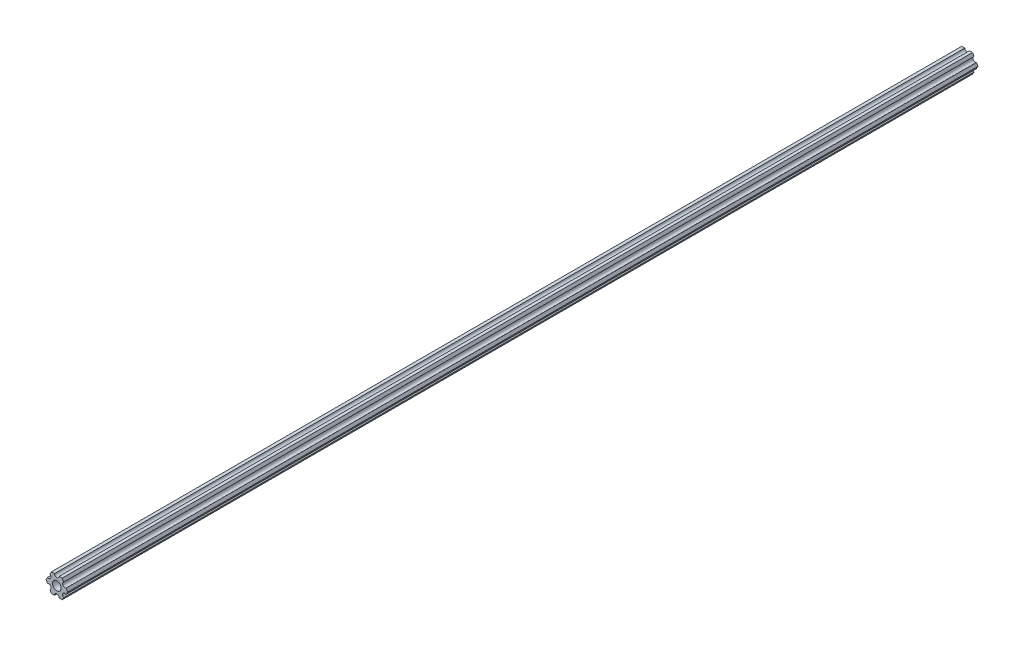
ISO-10303-21;
HEADER;
FILE_DESCRIPTION(('STEP AP214'),'2;1');
FILE_NAME('part.step','',(''),(''),'','','');
FILE_SCHEMA(('AUTOMOTIVE_DESIGN { 1 0 10303 214 1 1 1 1 }'));
ENDSEC;
DATA;
#1=APPLICATION_CONTEXT('core data for automotive mechanical design processes');
#2=APPLICATION_PROTOCOL_DEFINITION('international standard','automotive_design',2000,#1);
#3=PRODUCT_CONTEXT('',#1,'mechanical');
#4=PRODUCT('Part','Part','',(#3));
#5=PRODUCT_RELATED_PRODUCT_CATEGORY('part','',(#4));
#6=PRODUCT_DEFINITION_FORMATION('','',#4);
#7=PRODUCT_DEFINITION_CONTEXT('part definition',#1,'design');
#8=PRODUCT_DEFINITION('design','',#6,#7);
#9=PRODUCT_DEFINITION_SHAPE('','',#8);
#10=(LENGTH_UNIT() NAMED_UNIT(*) SI_UNIT(.MILLI.,.METRE.));
#11=(NAMED_UNIT(*) PLANE_ANGLE_UNIT() SI_UNIT($,.RADIAN.));
#12=(NAMED_UNIT(*) SI_UNIT($,.STERADIAN.) SOLID_ANGLE_UNIT());
#13=UNCERTAINTY_MEASURE_WITH_UNIT(LENGTH_MEASURE(1.E-05),#10,'distance_accuracy_value','');
#14=(GEOMETRIC_REPRESENTATION_CONTEXT(3) GLOBAL_UNCERTAINTY_ASSIGNED_CONTEXT((#13)) GLOBAL_UNIT_ASSIGNED_CONTEXT((#10,
#11,#12)) REPRESENTATION_CONTEXT('',''));
#15=CARTESIAN_POINT('',(0.,0.,0.));
#16=DIRECTION('',(0.,0.,1.));
#17=DIRECTION('',(1.,0.,0.));
#18=AXIS2_PLACEMENT_3D('',#15,#16,#17);
#19=CARTESIAN_POINT('',(5.49926112168156,3.17500033315933,615.95));
#20=DIRECTION('',(0.,0.,1.));
#21=DIRECTION('',(1.,0.,0.));
#22=AXIS2_PLACEMENT_3D('',#19,#20,#21);
#23=PLANE('',#22);
#24=DIRECTION('',(0.499999947533953,0.866025434075723,0.));
#25=VECTOR('',#24,1.);
#26=CARTESIAN_POINT('',(6.29301142309098,-1.80018429024546,615.95));
#27=LINE('',#26,#25);
#28=CARTESIAN_POINT('',(6.29301142309098,-1.80018429024546,615.95));
#29=VERTEX_POINT('',#28);
#30=CARTESIAN_POINT('',(7.33234841870826,4.44212519169686E-07,615.95));
#31=VERTEX_POINT('',#30);
#32=EDGE_CURVE('E226',#29,#31,#27,.T.);
#33=ORIENTED_EDGE('',*,*,#32,.T.);
#34=DIRECTION('',(-0.500000052466056,0.866025373493145,0.));
#35=VECTOR('',#34,1.);
#36=CARTESIAN_POINT('',(7.33234841870826,4.44212519169686E-07,615.95));
#37=LINE('',#36,#35);
#38=CARTESIAN_POINT('',(6.29301120497139,1.80018505273894,615.95));
#39=VERTEX_POINT('',#38);
#40=EDGE_CURVE('E124',#31,#39,#37,.T.);
#41=ORIENTED_EDGE('',*,*,#40,.T.);
#42=CARTESIAN_POINT('',(5.49926112168156,3.17500033315933,615.95));
#43=DIRECTION('',(0.,0.,-1.));
#44=DIRECTION('',(1.,0.,0.));
#45=AXIS2_PLACEMENT_3D('',#42,#43,#44);
#46=CIRCLE('',#45,1.5875);
#47=CARTESIAN_POINT('',(4.70551103839172,4.54981561357972,615.95));
#48=VERTEX_POINT('',#47);
#49=EDGE_CURVE('E271',#39,#48,#46,.T.);
#50=ORIENTED_EDGE('',*,*,#49,.T.);
#51=DIRECTION('',(-0.500000052466046,0.866025373493151,0.));
#52=VECTOR('',#51,1.);
#53=CARTESIAN_POINT('',(4.70551103839172,4.54981561357972,615.95));
#54=LINE('',#53,#52);
#55=CARTESIAN_POINT('',(3.66617382465481,6.35000022210627,615.95));
#56=VERTEX_POINT('',#55);
#57=EDGE_CURVE('E290',#48,#56,#54,.T.);
#58=ORIENTED_EDGE('',*,*,#57,.T.);
#59=DIRECTION('',(-0.999999999999998,-6.05825850611185E-08,0.));
#60=VECTOR('',#59,1.);
#61=CARTESIAN_POINT('',(3.66617382465481,6.35000022210627,615.95));
#62=LINE('',#61,#60);
#63=CARTESIAN_POINT('',(1.58749961530074,6.35000009617482,615.95));
#64=VERTEX_POINT('',#63);
#65=EDGE_CURVE('E287',#56,#64,#62,.T.);
#66=ORIENTED_EDGE('',*,*,#65,.T.);
#67=CARTESIAN_POINT('',(-3.84699260060323E-07,6.35,615.95));
#68=DIRECTION('',(0.,0.,-1.));
#69=DIRECTION('',(1.,0.,0.));
#70=AXIS2_PLACEMENT_3D('',#67,#68,#69);
#71=CIRCLE('',#70,1.5875);
#72=CARTESIAN_POINT('',(-1.58750038469926,6.34999990382518,615.95));
#73=VERTEX_POINT('',#72);
#74=EDGE_CURVE('E289',#64,#73,#71,.T.);
#75=ORIENTED_EDGE('',*,*,#74,.T.);
#76=DIRECTION('',(-0.999999999999998,-6.05825963273174E-08,0.));
#77=VECTOR('',#76,1.);
#78=CARTESIAN_POINT('',(-1.58750038469926,6.34999990382518,615.95));
#79=LINE('',#78,#77);
#80=CARTESIAN_POINT('',(-3.66617459405349,6.3499997778937,615.95));
#81=VERTEX_POINT('',#80);
#82=EDGE_CURVE('E292',#73,#81,#79,.T.);
#83=ORIENTED_EDGE('',*,*,#82,.T.);
#84=DIRECTION('',(-0.499999947533942,-0.866025434075729,0.));
#85=VECTOR('',#84,1.);
#86=CARTESIAN_POINT('',(-3.66617459405349,6.3499997778937,615.95));
#87=LINE('',#86,#85);
#88=CARTESIAN_POINT('',(-4.70551158967065,4.54981504343587,615.95));
#89=VERTEX_POINT('',#88);
#90=EDGE_CURVE('E298',#81,#89,#87,.T.);
#91=ORIENTED_EDGE('',*,*,#90,.T.);
#92=CARTESIAN_POINT('',(-5.49926150638082,3.17499966684067,615.95));
#93=DIRECTION('',(0.,0.,-1.));
#94=DIRECTION('',(1.,0.,0.));
#95=AXIS2_PLACEMENT_3D('',#92,#93,#94);
#96=CIRCLE('',#95,1.5875);
#97=CARTESIAN_POINT('',(-6.29301142309098,1.80018429024547,615.95));
#98=VERTEX_POINT('',#97);
#99=EDGE_CURVE('E300',#89,#98,#96,.T.);
#100=ORIENTED_EDGE('',*,*,#99,.T.);
#101=DIRECTION('',(-0.499999947533951,-0.866025434075724,0.));
#102=VECTOR('',#101,1.);
#103=CARTESIAN_POINT('',(-6.29301142309098,1.80018429024547,615.95));
#104=LINE('',#103,#102);
#105=CARTESIAN_POINT('',(-7.33234841870826,-4.44212523790841E-07,615.95));
#106=VERTEX_POINT('',#105);
#107=EDGE_CURVE('E302',#98,#106,#104,.T.);
#108=ORIENTED_EDGE('',*,*,#107,.T.);
#109=DIRECTION('',(0.500000052466045,-0.866025373493151,0.));
#110=VECTOR('',#109,1.);
#111=CARTESIAN_POINT('',(-7.33234841870826,-4.44212523790841E-07,615.95));
#112=LINE('',#111,#110);
#113=CARTESIAN_POINT('',(-6.29301120497141,-1.80018505273897,615.95));
#114=VERTEX_POINT('',#113);
#115=EDGE_CURVE('E304',#106,#114,#112,.T.);
#116=ORIENTED_EDGE('',*,*,#115,.T.);
#117=CARTESIAN_POINT('',(-5.49926112168156,-3.17500033315934,615.95));
#118=DIRECTION('',(0.,0.,-1.));
#119=DIRECTION('',(1.,0.,0.));
#120=AXIS2_PLACEMENT_3D('',#117,#118,#119);
#121=CIRCLE('',#120,1.5875);
#122=CARTESIAN_POINT('',(-4.70551103839172,-4.54981561357972,615.95));
#123=VERTEX_POINT('',#122);
#124=EDGE_CURVE('E306',#114,#123,#121,.T.);
#125=ORIENTED_EDGE('',*,*,#124,.T.);
#126=DIRECTION('',(0.500000052466045,-0.866025373493151,0.));
#127=VECTOR('',#126,1.);
#128=CARTESIAN_POINT('',(-4.70551103839172,-4.54981561357972,615.95));
#129=LINE('',#128,#127);
#130=CARTESIAN_POINT('',(-3.66617382465481,-6.35000022210628,615.95));
#131=VERTEX_POINT('',#130);
#132=EDGE_CURVE('E308',#123,#131,#129,.T.);
#133=ORIENTED_EDGE('',*,*,#132,.T.);
#134=DIRECTION('',(0.999999999999998,6.05825854783851E-08,0.));
#135=VECTOR('',#134,1.);
#136=CARTESIAN_POINT('',(-3.66617382465481,-6.35000022210628,615.95));
#137=LINE('',#136,#135);
#138=CARTESIAN_POINT('',(-1.58749961530074,-6.35000009617482,615.95));
#139=VERTEX_POINT('',#138);
#140=EDGE_CURVE('E310',#131,#139,#137,.T.);
#141=ORIENTED_EDGE('',*,*,#140,.T.);
#142=CARTESIAN_POINT('',(3.8469926204343E-07,-6.35,615.95));
#143=DIRECTION('',(0.,0.,-1.));
#144=DIRECTION('',(1.,0.,0.));
#145=AXIS2_PLACEMENT_3D('',#142,#143,#144);
#146=CIRCLE('',#145,1.5875);
#147=CARTESIAN_POINT('',(1.58750038469926,-6.34999990382518,615.95));
#148=VERTEX_POINT('',#147);
#149=EDGE_CURVE('E173',#139,#148,#146,.T.);
#150=ORIENTED_EDGE('',*,*,#149,.T.);
#151=DIRECTION('',(0.999999999999998,6.05825721258438E-08,0.));
#152=VECTOR('',#151,1.);
#153=CARTESIAN_POINT('',(1.58750038469926,-6.34999990382518,615.95));
#154=LINE('',#153,#152);
#155=CARTESIAN_POINT('',(3.66617459405346,-6.34999977789375,615.95));
#156=VERTEX_POINT('',#155);
#157=EDGE_CURVE('E167',#148,#156,#154,.T.);
#158=ORIENTED_EDGE('',*,*,#157,.T.);
#159=DIRECTION('',(0.499999947533941,0.86602543407573,0.));
#160=VECTOR('',#159,1.);
#161=CARTESIAN_POINT('',(3.66617459405346,-6.34999977789375,615.95));
#162=LINE('',#161,#160);
#163=CARTESIAN_POINT('',(4.70551158967065,-4.54981504343587,615.95));
#164=VERTEX_POINT('',#163);
#165=EDGE_CURVE('E171',#156,#164,#162,.T.);
#166=ORIENTED_EDGE('',*,*,#165,.T.);
#167=CARTESIAN_POINT('',(5.49926150638082,-3.17499966684067,615.95));
#168=DIRECTION('',(0.,0.,-1.));
#169=DIRECTION('',(1.,0.,0.));
#170=AXIS2_PLACEMENT_3D('',#167,#168,#169);
#171=CIRCLE('',#170,1.58750000000001);
#172=EDGE_CURVE('E51',#164,#29,#171,.T.);
#173=ORIENTED_EDGE('',*,*,#172,.T.);
#174=EDGE_LOOP('',(#33,#41,#50,#58,#66,#75,#83,#91,#100,#108,#116,#125,#133,#141,#150,#158,#166,#173));
#175=FACE_BOUND('',#174,.T.);
#176=CARTESIAN_POINT('',(0.,0.,615.95));
#177=DIRECTION('',(0.,0.,1.));
#178=DIRECTION('',(1.,0.,0.));
#179=AXIS2_PLACEMENT_3D('',#176,#177,#178);
#180=CIRCLE('',#179,2.9337);
#181=CARTESIAN_POINT('',(2.9337,0.,615.95));
#182=VERTEX_POINT('',#181);
#183=EDGE_CURVE('E195',#182,#182,#180,.T.);
#184=ORIENTED_EDGE('',*,*,#183,.F.);
#185=EDGE_LOOP('',(#184));
#186=FACE_BOUND('',#185,.T.);
#187=ADVANCED_FACE('F34',(#175,#186),#23,.T.);
#188=CARTESIAN_POINT('',(5.49926112168156,3.17500033315933,0.));
#189=DIRECTION('',(0.,0.,1.));
#190=DIRECTION('',(1.,0.,0.));
#191=AXIS2_PLACEMENT_3D('',#188,#189,#190);
#192=PLANE('',#191);
#193=DIRECTION('',(0.499999947533953,0.866025434075723,0.));
#194=VECTOR('',#193,1.);
#195=CARTESIAN_POINT('',(6.29301142309098,-1.80018429024546,0.));
#196=LINE('',#195,#194);
#197=CARTESIAN_POINT('',(6.29301142309098,-1.80018429024546,0.));
#198=VERTEX_POINT('',#197);
#199=CARTESIAN_POINT('',(7.33234841870826,4.44212519169686E-07,0.));
#200=VERTEX_POINT('',#199);
#201=EDGE_CURVE('E191',#198,#200,#196,.T.);
#202=ORIENTED_EDGE('',*,*,#201,.F.);
#203=CARTESIAN_POINT('',(5.49926150638082,-3.17499966684067,0.));
#204=DIRECTION('',(0.,0.,-1.));
#205=DIRECTION('',(1.,0.,0.));
#206=AXIS2_PLACEMENT_3D('',#203,#204,#205);
#207=CIRCLE('',#206,1.58750000000001);
#208=CARTESIAN_POINT('',(4.70551158967065,-4.54981504343587,0.));
#209=VERTEX_POINT('',#208);
#210=EDGE_CURVE('E116',#209,#198,#207,.T.);
#211=ORIENTED_EDGE('',*,*,#210,.F.);
#212=DIRECTION('',(0.499999947533941,0.86602543407573,0.));
#213=VECTOR('',#212,1.);
#214=CARTESIAN_POINT('',(3.66617459405346,-6.34999977789375,0.));
#215=LINE('',#214,#213);
#216=CARTESIAN_POINT('',(3.66617459405346,-6.34999977789375,0.));
#217=VERTEX_POINT('',#216);
#218=EDGE_CURVE('E110',#217,#209,#215,.T.);
#219=ORIENTED_EDGE('',*,*,#218,.F.);
#220=DIRECTION('',(0.999999999999998,6.05825721258438E-08,0.));
#221=VECTOR('',#220,1.);
#222=CARTESIAN_POINT('',(1.58750038469926,-6.34999990382518,0.));
#223=LINE('',#222,#221);
#224=CARTESIAN_POINT('',(1.58750038469926,-6.34999990382518,0.));
#225=VERTEX_POINT('',#224);
#226=EDGE_CURVE('E181',#225,#217,#223,.T.);
#227=ORIENTED_EDGE('',*,*,#226,.F.);
#228=CARTESIAN_POINT('',(3.8469926204343E-07,-6.35,0.));
#229=DIRECTION('',(0.,0.,-1.));
#230=DIRECTION('',(1.,0.,0.));
#231=AXIS2_PLACEMENT_3D('',#228,#229,#230);
#232=CIRCLE('',#231,1.5875);
#233=CARTESIAN_POINT('',(-1.58749961530074,-6.35000009617482,0.));
#234=VERTEX_POINT('',#233);
#235=EDGE_CURVE('E221',#234,#225,#232,.T.);
#236=ORIENTED_EDGE('',*,*,#235,.F.);
#237=DIRECTION('',(0.999999999999998,6.05825854783851E-08,0.));
#238=VECTOR('',#237,1.);
#239=CARTESIAN_POINT('',(-3.66617382465481,-6.35000022210628,0.));
#240=LINE('',#239,#238);
#241=CARTESIAN_POINT('',(-3.66617382465481,-6.35000022210628,0.));
#242=VERTEX_POINT('',#241);
#243=EDGE_CURVE('E219',#242,#234,#240,.T.);
#244=ORIENTED_EDGE('',*,*,#243,.F.);
#245=DIRECTION('',(0.500000052466045,-0.866025373493151,0.));
#246=VECTOR('',#245,1.);
#247=CARTESIAN_POINT('',(-4.70551103839172,-4.54981561357972,0.));
#248=LINE('',#247,#246);
#249=CARTESIAN_POINT('',(-4.70551103839172,-4.54981561357972,0.));
#250=VERTEX_POINT('',#249);
#251=EDGE_CURVE('E217',#250,#242,#248,.T.);
#252=ORIENTED_EDGE('',*,*,#251,.F.);
#253=CARTESIAN_POINT('',(-5.49926112168156,-3.17500033315934,0.));
#254=DIRECTION('',(0.,0.,-1.));
#255=DIRECTION('',(1.,0.,0.));
#256=AXIS2_PLACEMENT_3D('',#253,#254,#255);
#257=CIRCLE('',#256,1.5875);
#258=CARTESIAN_POINT('',(-6.29301120497141,-1.80018505273897,0.));
#259=VERTEX_POINT('',#258);
#260=EDGE_CURVE('E215',#259,#250,#257,.T.);
#261=ORIENTED_EDGE('',*,*,#260,.F.);
#262=DIRECTION('',(0.500000052466045,-0.866025373493151,0.));
#263=VECTOR('',#262,1.);
#264=CARTESIAN_POINT('',(-7.33234841870826,-4.44212523790841E-07,0.));
#265=LINE('',#264,#263);
#266=CARTESIAN_POINT('',(-7.33234841870826,-4.44212523790841E-07,0.));
#267=VERTEX_POINT('',#266);
#268=EDGE_CURVE('E213',#267,#259,#265,.T.);
#269=ORIENTED_EDGE('',*,*,#268,.F.);
#270=DIRECTION('',(-0.499999947533951,-0.866025434075724,0.));
#271=VECTOR('',#270,1.);
#272=CARTESIAN_POINT('',(-6.29301142309098,1.80018429024547,0.));
#273=LINE('',#272,#271);
#274=CARTESIAN_POINT('',(-6.29301142309098,1.80018429024547,0.));
#275=VERTEX_POINT('',#274);
#276=EDGE_CURVE('E211',#275,#267,#273,.T.);
#277=ORIENTED_EDGE('',*,*,#276,.F.);
#278=CARTESIAN_POINT('',(-5.49926150638082,3.17499966684067,0.));
#279=DIRECTION('',(0.,0.,-1.));
#280=DIRECTION('',(1.,0.,0.));
#281=AXIS2_PLACEMENT_3D('',#278,#279,#280);
#282=CIRCLE('',#281,1.5875);
#283=CARTESIAN_POINT('',(-4.70551158967065,4.54981504343587,0.));
#284=VERTEX_POINT('',#283);
#285=EDGE_CURVE('E209',#284,#275,#282,.T.);
#286=ORIENTED_EDGE('',*,*,#285,.F.);
#287=DIRECTION('',(-0.499999947533942,-0.866025434075729,0.));
#288=VECTOR('',#287,1.);
#289=CARTESIAN_POINT('',(-3.66617459405349,6.3499997778937,0.));
#290=LINE('',#289,#288);
#291=CARTESIAN_POINT('',(-3.66617459405349,6.3499997778937,0.));
#292=VERTEX_POINT('',#291);
#293=EDGE_CURVE('E207',#292,#284,#290,.T.);
#294=ORIENTED_EDGE('',*,*,#293,.F.);
#295=DIRECTION('',(-0.999999999999998,-6.05825963273174E-08,0.));
#296=VECTOR('',#295,1.);
#297=CARTESIAN_POINT('',(-1.58750038469926,6.34999990382518,0.));
#298=LINE('',#297,#296);
#299=CARTESIAN_POINT('',(-1.58750038469926,6.34999990382518,0.));
#300=VERTEX_POINT('',#299);
#301=EDGE_CURVE('E205',#300,#292,#298,.T.);
#302=ORIENTED_EDGE('',*,*,#301,.F.);
#303=CARTESIAN_POINT('',(-3.84699260060323E-07,6.35,0.));
#304=DIRECTION('',(0.,0.,-1.));
#305=DIRECTION('',(1.,0.,0.));
#306=AXIS2_PLACEMENT_3D('',#303,#304,#305);
#307=CIRCLE('',#306,1.5875);
#308=CARTESIAN_POINT('',(1.58749961530074,6.35000009617482,0.));
#309=VERTEX_POINT('',#308);
#310=EDGE_CURVE('E203',#309,#300,#307,.T.);
#311=ORIENTED_EDGE('',*,*,#310,.F.);
#312=DIRECTION('',(-0.999999999999998,-6.05825850611185E-08,0.));
#313=VECTOR('',#312,1.);
#314=CARTESIAN_POINT('',(3.66617382465481,6.35000022210627,0.));
#315=LINE('',#314,#313);
#316=CARTESIAN_POINT('',(3.66617382465481,6.35000022210627,0.));
#317=VERTEX_POINT('',#316);
#318=EDGE_CURVE('E201',#317,#309,#315,.T.);
#319=ORIENTED_EDGE('',*,*,#318,.F.);
#320=DIRECTION('',(-0.500000052466046,0.866025373493151,0.));
#321=VECTOR('',#320,1.);
#322=CARTESIAN_POINT('',(4.70551103839172,4.54981561357972,0.));
#323=LINE('',#322,#321);
#324=CARTESIAN_POINT('',(4.70551103839172,4.54981561357972,0.));
#325=VERTEX_POINT('',#324);
#326=EDGE_CURVE('E199',#325,#317,#323,.T.);
#327=ORIENTED_EDGE('',*,*,#326,.F.);
#328=CARTESIAN_POINT('',(5.49926112168156,3.17500033315933,0.));
#329=DIRECTION('',(0.,0.,-1.));
#330=DIRECTION('',(1.,0.,0.));
#331=AXIS2_PLACEMENT_3D('',#328,#329,#330);
#332=CIRCLE('',#331,1.5875);
#333=CARTESIAN_POINT('',(6.29301120497139,1.80018505273894,0.));
#334=VERTEX_POINT('',#333);
#335=EDGE_CURVE('E197',#334,#325,#332,.T.);
#336=ORIENTED_EDGE('',*,*,#335,.F.);
#337=DIRECTION('',(-0.500000052466056,0.866025373493145,0.));
#338=VECTOR('',#337,1.);
#339=CARTESIAN_POINT('',(7.33234841870826,4.44212519169686E-07,0.));
#340=LINE('',#339,#338);
#341=EDGE_CURVE('E194',#200,#334,#340,.T.);
#342=ORIENTED_EDGE('',*,*,#341,.F.);
#343=EDGE_LOOP('',(#202,#211,#219,#227,#236,#244,#252,#261,#269,#277,#286,#294,#302,#311,#319,
#327,#336,#342));
#344=FACE_BOUND('',#343,.T.);
#345=CARTESIAN_POINT('',(0.,0.,0.));
#346=DIRECTION('',(0.,0.,1.));
#347=DIRECTION('',(1.,0.,0.));
#348=AXIS2_PLACEMENT_3D('',#345,#346,#347);
#349=CIRCLE('',#348,2.9337);
#350=CARTESIAN_POINT('',(2.9337,0.,0.));
#351=VERTEX_POINT('',#350);
#352=EDGE_CURVE('E535',#351,#351,#349,.T.);
#353=ORIENTED_EDGE('',*,*,#352,.T.);
#354=EDGE_LOOP('',(#353));
#355=FACE_BOUND('',#354,.T.);
#356=ADVANCED_FACE('F275',(#344,#355),#192,.F.);
#357=CARTESIAN_POINT('',(6.29301142309098,-1.80018429024546,615.95));
#358=DIRECTION('',(-0.866025434075723,0.499999947533953,0.));
#359=DIRECTION('',(-0.499999947533953,-0.866025434075723,0.));
#360=AXIS2_PLACEMENT_3D('',#357,#358,#359);
#361=PLANE('',#360);
#362=ORIENTED_EDGE('',*,*,#201,.T.);
#363=DIRECTION('',(0.,0.,-1.));
#364=VECTOR('',#363,1.);
#365=CARTESIAN_POINT('',(7.33234841870826,4.44212519169686E-07,615.95));
#366=LINE('',#365,#364);
#367=EDGE_CURVE('E11',#31,#200,#366,.T.);
#368=ORIENTED_EDGE('',*,*,#367,.F.);
#369=ORIENTED_EDGE('',*,*,#32,.F.);
#370=DIRECTION('',(0.,0.,-1.));
#371=VECTOR('',#370,1.);
#372=CARTESIAN_POINT('',(6.29301142309098,-1.80018429024546,615.95));
#373=LINE('',#372,#371);
#374=EDGE_CURVE('E187',#29,#198,#373,.T.);
#375=ORIENTED_EDGE('',*,*,#374,.T.);
#376=EDGE_LOOP('',(#362,#368,#369,#375));
#377=FACE_BOUND('',#376,.T.);
#378=ADVANCED_FACE('F36',(#377),#361,.F.);
#379=CARTESIAN_POINT('',(7.33234841870826,4.44212519169686E-07,615.95));
#380=DIRECTION('',(-0.866025373493145,-0.500000052466056,0.));
#381=DIRECTION('',(0.500000052466056,-0.866025373493145,0.));
#382=AXIS2_PLACEMENT_3D('',#379,#380,#381);
#383=PLANE('',#382);
#384=ORIENTED_EDGE('',*,*,#341,.T.);
#385=DIRECTION('',(0.,0.,-1.));
#386=VECTOR('',#385,1.);
#387=CARTESIAN_POINT('',(6.29301120497139,1.80018505273894,615.95));
#388=LINE('',#387,#386);
#389=EDGE_CURVE('E43',#39,#334,#388,.T.);
#390=ORIENTED_EDGE('',*,*,#389,.F.);
#391=ORIENTED_EDGE('',*,*,#40,.F.);
#392=ORIENTED_EDGE('',*,*,#367,.T.);
#393=EDGE_LOOP('',(#384,#390,#391,#392));
#394=FACE_BOUND('',#393,.T.);
#395=ADVANCED_FACE('F344',(#394),#383,.F.);
#396=CARTESIAN_POINT('',(5.49926112168156,3.17500033315933,615.95));
#397=DIRECTION('',(0.,0.,-1.));
#398=DIRECTION('',(-1.,0.,0.));
#399=AXIS2_PLACEMENT_3D('',#396,#397,#398);
#400=CYLINDRICAL_SURFACE('',#399,1.5875);
#401=ORIENTED_EDGE('',*,*,#335,.T.);
#402=DIRECTION('',(0.,0.,-1.));
#403=VECTOR('',#402,1.);
#404=CARTESIAN_POINT('',(4.70551103839172,4.54981561357972,615.95));
#405=LINE('',#404,#403);
#406=EDGE_CURVE('E263',#48,#325,#405,.T.);
#407=ORIENTED_EDGE('',*,*,#406,.F.);
#408=ORIENTED_EDGE('',*,*,#49,.F.);
#409=ORIENTED_EDGE('',*,*,#389,.T.);
#410=EDGE_LOOP('',(#401,#407,#408,#409));
#411=FACE_BOUND('',#410,.T.);
#412=ADVANCED_FACE('F269',(#411),#400,.F.);
#413=CARTESIAN_POINT('',(4.70551103839172,4.54981561357972,615.95));
#414=DIRECTION('',(-0.866025373493151,-0.500000052466046,0.));
#415=DIRECTION('',(0.500000052466046,-0.866025373493151,0.));
#416=AXIS2_PLACEMENT_3D('',#413,#414,#415);
#417=PLANE('',#416);
#418=ORIENTED_EDGE('',*,*,#326,.T.);
#419=DIRECTION('',(0.,0.,-1.));
#420=VECTOR('',#419,1.);
#421=CARTESIAN_POINT('',(3.66617382465481,6.35000022210627,615.95));
#422=LINE('',#421,#420);
#423=EDGE_CURVE('E260',#56,#317,#422,.T.);
#424=ORIENTED_EDGE('',*,*,#423,.F.);
#425=ORIENTED_EDGE('',*,*,#57,.F.);
#426=ORIENTED_EDGE('',*,*,#406,.T.);
#427=EDGE_LOOP('',(#418,#424,#425,#426));
#428=FACE_BOUND('',#427,.T.);
#429=ADVANCED_FACE('F281',(#428),#417,.F.);
#430=CARTESIAN_POINT('',(3.66617382465481,6.35000022210627,615.95));
#431=DIRECTION('',(6.05825850611185E-08,-0.999999999999998,0.));
#432=DIRECTION('',(0.999999999999998,6.05825850611185E-08,0.));
#433=AXIS2_PLACEMENT_3D('',#430,#431,#432);
#434=PLANE('',#433);
#435=ORIENTED_EDGE('',*,*,#318,.T.);
#436=DIRECTION('',(0.,0.,-1.));
#437=VECTOR('',#436,1.);
#438=CARTESIAN_POINT('',(1.58749961530074,6.35000009617482,615.95));
#439=LINE('',#438,#437);
#440=EDGE_CURVE('E257',#64,#309,#439,.T.);
#441=ORIENTED_EDGE('',*,*,#440,.F.);
#442=ORIENTED_EDGE('',*,*,#65,.F.);
#443=ORIENTED_EDGE('',*,*,#423,.T.);
#444=EDGE_LOOP('',(#435,#441,#442,#443));
#445=FACE_BOUND('',#444,.T.);
#446=ADVANCED_FACE('F285',(#445),#434,.F.);
#447=CARTESIAN_POINT('',(-3.84699260060323E-07,6.35,615.95));
#448=DIRECTION('',(0.,0.,-1.));
#449=DIRECTION('',(-1.,0.,0.));
#450=AXIS2_PLACEMENT_3D('',#447,#448,#449);
#451=CYLINDRICAL_SURFACE('',#450,1.5875);
#452=ORIENTED_EDGE('',*,*,#310,.T.);
#453=DIRECTION('',(0.,0.,-1.));
#454=VECTOR('',#453,1.);
#455=CARTESIAN_POINT('',(-1.58750038469926,6.34999990382518,615.95));
#456=LINE('',#455,#454);
#457=EDGE_CURVE('E254',#73,#300,#456,.T.);
#458=ORIENTED_EDGE('',*,*,#457,.F.);
#459=ORIENTED_EDGE('',*,*,#74,.F.);
#460=ORIENTED_EDGE('',*,*,#440,.T.);
#461=EDGE_LOOP('',(#452,#458,#459,#460));
#462=FACE_BOUND('',#461,.T.);
#463=ADVANCED_FACE('F357',(#462),#451,.F.);
#464=CARTESIAN_POINT('',(-1.58750038469926,6.34999990382518,615.95));
#465=DIRECTION('',(6.05825963273174E-08,-0.999999999999998,0.));
#466=DIRECTION('',(0.999999999999998,6.05825963273174E-08,0.));
#467=AXIS2_PLACEMENT_3D('',#464,#465,#466);
#468=PLANE('',#467);
#469=ORIENTED_EDGE('',*,*,#301,.T.);
#470=DIRECTION('',(0.,0.,-1.));
#471=VECTOR('',#470,1.);
#472=CARTESIAN_POINT('',(-3.66617459405349,6.3499997778937,615.95));
#473=LINE('',#472,#471);
#474=EDGE_CURVE('E251',#81,#292,#473,.T.);
#475=ORIENTED_EDGE('',*,*,#474,.F.);
#476=ORIENTED_EDGE('',*,*,#82,.F.);
#477=ORIENTED_EDGE('',*,*,#457,.T.);
#478=EDGE_LOOP('',(#469,#475,#476,#477));
#479=FACE_BOUND('',#478,.T.);
#480=ADVANCED_FACE('F360',(#479),#468,.F.);
#481=CARTESIAN_POINT('',(-3.66617459405349,6.3499997778937,615.95));
#482=DIRECTION('',(0.866025434075729,-0.499999947533942,0.));
#483=DIRECTION('',(0.499999947533942,0.866025434075729,0.));
#484=AXIS2_PLACEMENT_3D('',#481,#482,#483);
#485=PLANE('',#484);
#486=ORIENTED_EDGE('',*,*,#293,.T.);
#487=DIRECTION('',(0.,0.,-1.));
#488=VECTOR('',#487,1.);
#489=CARTESIAN_POINT('',(-4.70551158967065,4.54981504343587,615.95));
#490=LINE('',#489,#488);
#491=EDGE_CURVE('E248',#89,#284,#490,.T.);
#492=ORIENTED_EDGE('',*,*,#491,.F.);
#493=ORIENTED_EDGE('',*,*,#90,.F.);
#494=ORIENTED_EDGE('',*,*,#474,.T.);
#495=EDGE_LOOP('',(#486,#492,#493,#494));
#496=FACE_BOUND('',#495,.T.);
#497=ADVANCED_FACE('F364',(#496),#485,.F.);
#498=CARTESIAN_POINT('',(-5.49926150638082,3.17499966684067,615.95));
#499=DIRECTION('',(0.,0.,-1.));
#500=DIRECTION('',(-1.,0.,0.));
#501=AXIS2_PLACEMENT_3D('',#498,#499,#500);
#502=CYLINDRICAL_SURFACE('',#501,1.5875);
#503=ORIENTED_EDGE('',*,*,#285,.T.);
#504=DIRECTION('',(0.,0.,-1.));
#505=VECTOR('',#504,1.);
#506=CARTESIAN_POINT('',(-6.29301142309098,1.80018429024547,615.95));
#507=LINE('',#506,#505);
#508=EDGE_CURVE('E245',#98,#275,#507,.T.);
#509=ORIENTED_EDGE('',*,*,#508,.F.);
#510=ORIENTED_EDGE('',*,*,#99,.F.);
#511=ORIENTED_EDGE('',*,*,#491,.T.);
#512=EDGE_LOOP('',(#503,#509,#510,#511));
#513=FACE_BOUND('',#512,.T.);
#514=ADVANCED_FACE('F368',(#513),#502,.F.);
#515=CARTESIAN_POINT('',(-6.29301142309098,1.80018429024547,615.95));
#516=DIRECTION('',(0.866025434075724,-0.499999947533952,0.));
#517=DIRECTION('',(0.499999947533952,0.866025434075724,0.));
#518=AXIS2_PLACEMENT_3D('',#515,#516,#517);
#519=PLANE('',#518);
#520=ORIENTED_EDGE('',*,*,#276,.T.);
#521=DIRECTION('',(0.,0.,-1.));
#522=VECTOR('',#521,1.);
#523=CARTESIAN_POINT('',(-7.33234841870826,-4.44212523790841E-07,615.95));
#524=LINE('',#523,#522);
#525=EDGE_CURVE('E242',#106,#267,#524,.T.);
#526=ORIENTED_EDGE('',*,*,#525,.F.);
#527=ORIENTED_EDGE('',*,*,#107,.F.);
#528=ORIENTED_EDGE('',*,*,#508,.T.);
#529=EDGE_LOOP('',(#520,#526,#527,#528));
#530=FACE_BOUND('',#529,.T.);
#531=ADVANCED_FACE('F372',(#530),#519,.F.);
#532=CARTESIAN_POINT('',(-7.33234841870826,-4.44212523790841E-07,615.95));
#533=DIRECTION('',(0.866025373493151,0.500000052466045,0.));
#534=DIRECTION('',(-0.500000052466045,0.866025373493151,0.));
#535=AXIS2_PLACEMENT_3D('',#532,#533,#534);
#536=PLANE('',#535);
#537=ORIENTED_EDGE('',*,*,#268,.T.);
#538=DIRECTION('',(0.,0.,-1.));
#539=VECTOR('',#538,1.);
#540=CARTESIAN_POINT('',(-6.29301120497141,-1.80018505273897,615.95));
#541=LINE('',#540,#539);
#542=EDGE_CURVE('E239',#114,#259,#541,.T.);
#543=ORIENTED_EDGE('',*,*,#542,.F.);
#544=ORIENTED_EDGE('',*,*,#115,.F.);
#545=ORIENTED_EDGE('',*,*,#525,.T.);
#546=EDGE_LOOP('',(#537,#543,#544,#545));
#547=FACE_BOUND('',#546,.T.);
#548=ADVANCED_FACE('F376',(#547),#536,.F.);
#549=CARTESIAN_POINT('',(-5.49926112168156,-3.17500033315934,615.95));
#550=DIRECTION('',(0.,0.,-1.));
#551=DIRECTION('',(-1.,0.,0.));
#552=AXIS2_PLACEMENT_3D('',#549,#550,#551);
#553=CYLINDRICAL_SURFACE('',#552,1.5875);
#554=ORIENTED_EDGE('',*,*,#260,.T.);
#555=DIRECTION('',(0.,0.,-1.));
#556=VECTOR('',#555,1.);
#557=CARTESIAN_POINT('',(-4.70551103839172,-4.54981561357972,615.95));
#558=LINE('',#557,#556);
#559=EDGE_CURVE('E236',#123,#250,#558,.T.);
#560=ORIENTED_EDGE('',*,*,#559,.F.);
#561=ORIENTED_EDGE('',*,*,#124,.F.);
#562=ORIENTED_EDGE('',*,*,#542,.T.);
#563=EDGE_LOOP('',(#554,#560,#561,#562));
#564=FACE_BOUND('',#563,.T.);
#565=ADVANCED_FACE('F380',(#564),#553,.F.);
#566=CARTESIAN_POINT('',(-4.70551103839172,-4.54981561357972,615.95));
#567=DIRECTION('',(0.866025373493151,0.500000052466045,0.));
#568=DIRECTION('',(-0.500000052466045,0.866025373493151,0.));
#569=AXIS2_PLACEMENT_3D('',#566,#567,#568);
#570=PLANE('',#569);
#571=ORIENTED_EDGE('',*,*,#251,.T.);
#572=DIRECTION('',(0.,0.,-1.));
#573=VECTOR('',#572,1.);
#574=CARTESIAN_POINT('',(-3.66617382465481,-6.35000022210628,615.95));
#575=LINE('',#574,#573);
#576=EDGE_CURVE('E233',#131,#242,#575,.T.);
#577=ORIENTED_EDGE('',*,*,#576,.F.);
#578=ORIENTED_EDGE('',*,*,#132,.F.);
#579=ORIENTED_EDGE('',*,*,#559,.T.);
#580=EDGE_LOOP('',(#571,#577,#578,#579));
#581=FACE_BOUND('',#580,.T.);
#582=ADVANCED_FACE('F384',(#581),#570,.F.);
#583=CARTESIAN_POINT('',(-3.66617382465481,-6.35000022210628,615.95));
#584=DIRECTION('',(-6.05825854783851E-08,0.999999999999998,0.));
#585=DIRECTION('',(-0.999999999999998,-6.05825854783851E-08,0.));
#586=AXIS2_PLACEMENT_3D('',#583,#584,#585);
#587=PLANE('',#586);
#588=ORIENTED_EDGE('',*,*,#243,.T.);
#589=DIRECTION('',(0.,0.,-1.));
#590=VECTOR('',#589,1.);
#591=CARTESIAN_POINT('',(-1.58749961530074,-6.35000009617482,615.95));
#592=LINE('',#591,#590);
#593=EDGE_CURVE('E230',#139,#234,#592,.T.);
#594=ORIENTED_EDGE('',*,*,#593,.F.);
#595=ORIENTED_EDGE('',*,*,#140,.F.);
#596=ORIENTED_EDGE('',*,*,#576,.T.);
#597=EDGE_LOOP('',(#588,#594,#595,#596));
#598=FACE_BOUND('',#597,.T.);
#599=ADVANCED_FACE('F316',(#598),#587,.F.);
#600=CARTESIAN_POINT('',(3.8469926204343E-07,-6.35,615.95));
#601=DIRECTION('',(0.,0.,-1.));
#602=DIRECTION('',(-1.,0.,0.));
#603=AXIS2_PLACEMENT_3D('',#600,#601,#602);
#604=CYLINDRICAL_SURFACE('',#603,1.5875);
#605=ORIENTED_EDGE('',*,*,#235,.T.);
#606=DIRECTION('',(0.,0.,-1.));
#607=VECTOR('',#606,1.);
#608=CARTESIAN_POINT('',(1.58750038469926,-6.34999990382518,615.95));
#609=LINE('',#608,#607);
#610=EDGE_CURVE('E182',#148,#225,#609,.T.);
#611=ORIENTED_EDGE('',*,*,#610,.F.);
#612=ORIENTED_EDGE('',*,*,#149,.F.);
#613=ORIENTED_EDGE('',*,*,#593,.T.);
#614=EDGE_LOOP('',(#605,#611,#612,#613));
#615=FACE_BOUND('',#614,.T.);
#616=ADVANCED_FACE('F320',(#615),#604,.F.);
#617=CARTESIAN_POINT('',(1.58750038469926,-6.34999990382518,615.95));
#618=DIRECTION('',(-6.05825721258438E-08,0.999999999999998,0.));
#619=DIRECTION('',(-0.999999999999998,-6.05825721258438E-08,0.));
#620=AXIS2_PLACEMENT_3D('',#617,#618,#619);
#621=PLANE('',#620);
#622=ORIENTED_EDGE('',*,*,#226,.T.);
#623=DIRECTION('',(0.,0.,-1.));
#624=VECTOR('',#623,1.);
#625=CARTESIAN_POINT('',(3.66617459405346,-6.34999977789375,615.95));
#626=LINE('',#625,#624);
#627=EDGE_CURVE('E178',#156,#217,#626,.T.);
#628=ORIENTED_EDGE('',*,*,#627,.F.);
#629=ORIENTED_EDGE('',*,*,#157,.F.);
#630=ORIENTED_EDGE('',*,*,#610,.T.);
#631=EDGE_LOOP('',(#622,#628,#629,#630));
#632=FACE_BOUND('',#631,.T.);
#633=ADVANCED_FACE('F179',(#632),#621,.F.);
#634=CARTESIAN_POINT('',(3.66617459405346,-6.34999977789375,615.95));
#635=DIRECTION('',(-0.86602543407573,0.499999947533941,0.));
#636=DIRECTION('',(-0.499999947533941,-0.86602543407573,0.));
#637=AXIS2_PLACEMENT_3D('',#634,#635,#636);
#638=PLANE('',#637);
#639=ORIENTED_EDGE('',*,*,#218,.T.);
#640=DIRECTION('',(0.,0.,-1.));
#641=VECTOR('',#640,1.);
#642=CARTESIAN_POINT('',(4.70551158967065,-4.54981504343587,615.95));
#643=LINE('',#642,#641);
#644=EDGE_CURVE('E183',#164,#209,#643,.T.);
#645=ORIENTED_EDGE('',*,*,#644,.F.);
#646=ORIENTED_EDGE('',*,*,#165,.F.);
#647=ORIENTED_EDGE('',*,*,#627,.T.);
#648=EDGE_LOOP('',(#639,#645,#646,#647));
#649=FACE_BOUND('',#648,.T.);
#650=ADVANCED_FACE('F185',(#649),#638,.F.);
#651=CARTESIAN_POINT('',(5.49926150638082,-3.17499966684067,615.95));
#652=DIRECTION('',(0.,0.,-1.));
#653=DIRECTION('',(-1.,0.,0.));
#654=AXIS2_PLACEMENT_3D('',#651,#652,#653);
#655=CYLINDRICAL_SURFACE('',#654,1.58750000000001);
#656=ORIENTED_EDGE('',*,*,#210,.T.);
#657=ORIENTED_EDGE('',*,*,#374,.F.);
#658=ORIENTED_EDGE('',*,*,#172,.F.);
#659=ORIENTED_EDGE('',*,*,#644,.T.);
#660=EDGE_LOOP('',(#656,#657,#658,#659));
#661=FACE_BOUND('',#660,.T.);
#662=ADVANCED_FACE('F324',(#661),#655,.F.);
#663=CARTESIAN_POINT('',(0.,0.,615.95));
#664=DIRECTION('',(0.,0.,-1.));
#665=DIRECTION('',(-1.,0.,0.));
#666=AXIS2_PLACEMENT_3D('',#663,#664,#665);
#667=CYLINDRICAL_SURFACE('',#666,2.9337);
#668=ORIENTED_EDGE('',*,*,#183,.T.);
#669=EDGE_LOOP('',(#668));
#670=FACE_BOUND('',#669,.T.);
#671=ORIENTED_EDGE('',*,*,#352,.F.);
#672=EDGE_LOOP('',(#671));
#673=FACE_BOUND('',#672,.T.);
#674=ADVANCED_FACE('F326',(#670,#673),#667,.F.);
#675=CLOSED_SHELL('',(#187,#356,#378,#395,#412,#429,#446,#463,#480,#497,#514,#531,#548,#565,
#582,#599,#616,#633,#650,#662,#674));
#676=MANIFOLD_SOLID_BREP('B2',#675);
#677=ADVANCED_BREP_SHAPE_REPRESENTATION('',(#18,#676),#14);
#678=SHAPE_DEFINITION_REPRESENTATION(#9,#677);
ENDSEC;
END-ISO-10303-21;
